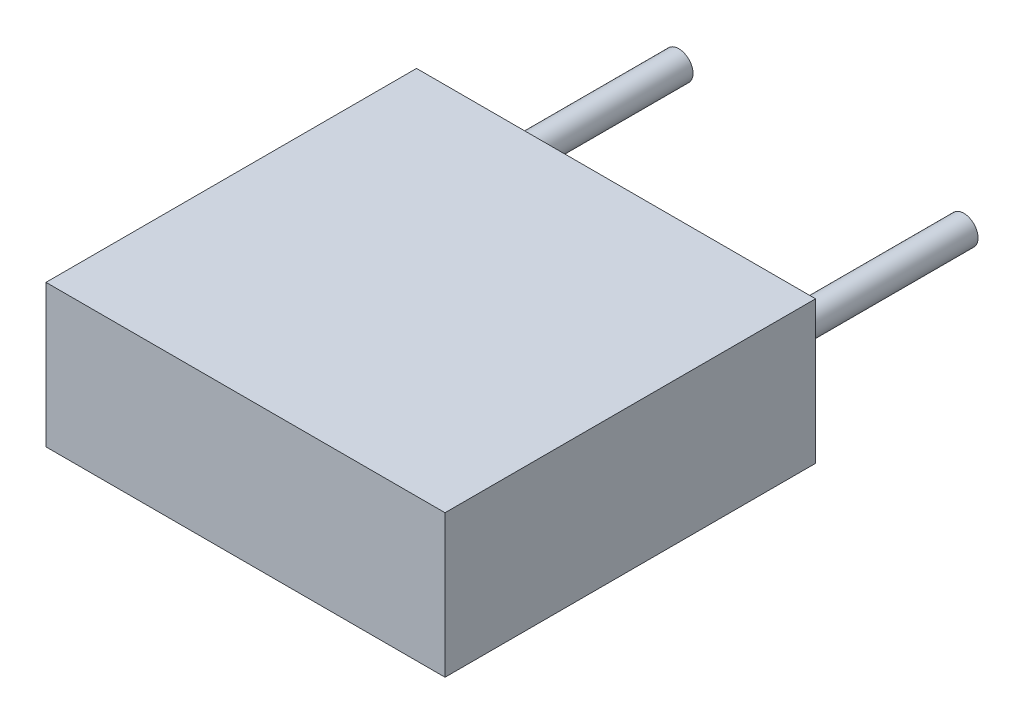
ISO-10303-21;
HEADER;
FILE_DESCRIPTION(('STEP AP214'),'2;1');
FILE_NAME('part.step','',(''),(''),'','','');
FILE_SCHEMA(('AUTOMOTIVE_DESIGN { 1 0 10303 214 1 1 1 1 }'));
ENDSEC;
DATA;
#1=APPLICATION_CONTEXT('core data for automotive mechanical design processes');
#2=APPLICATION_PROTOCOL_DEFINITION('international standard','automotive_design',2000,#1);
#3=PRODUCT_CONTEXT('',#1,'mechanical');
#4=PRODUCT('Part','Part','',(#3));
#5=PRODUCT_RELATED_PRODUCT_CATEGORY('part','',(#4));
#6=PRODUCT_DEFINITION_FORMATION('','',#4);
#7=PRODUCT_DEFINITION_CONTEXT('part definition',#1,'design');
#8=PRODUCT_DEFINITION('design','',#6,#7);
#9=PRODUCT_DEFINITION_SHAPE('','',#8);
#10=(LENGTH_UNIT() NAMED_UNIT(*) SI_UNIT(.MILLI.,.METRE.));
#11=(NAMED_UNIT(*) PLANE_ANGLE_UNIT() SI_UNIT($,.RADIAN.));
#12=(NAMED_UNIT(*) SI_UNIT($,.STERADIAN.) SOLID_ANGLE_UNIT());
#13=UNCERTAINTY_MEASURE_WITH_UNIT(LENGTH_MEASURE(1.E-05),#10,'distance_accuracy_value','');
#14=(GEOMETRIC_REPRESENTATION_CONTEXT(3) GLOBAL_UNCERTAINTY_ASSIGNED_CONTEXT((#13)) GLOBAL_UNIT_ASSIGNED_CONTEXT((#10,
#11,#12)) REPRESENTATION_CONTEXT('',''));
#15=CARTESIAN_POINT('',(0.,0.,0.));
#16=DIRECTION('',(0.,0.,1.));
#17=DIRECTION('',(1.,0.,0.));
#18=AXIS2_PLACEMENT_3D('',#15,#16,#17);
#19=CARTESIAN_POINT('',(3.5,-1.25,6.5));
#20=DIRECTION('',(-1.,0.,0.));
#21=DIRECTION('',(0.,0.,1.));
#22=AXIS2_PLACEMENT_3D('',#19,#20,#21);
#23=PLANE('',#22);
#24=DIRECTION('',(0.,1.,0.));
#25=VECTOR('',#24,1.);
#26=CARTESIAN_POINT('',(3.5,-1.25,0.));
#27=LINE('',#26,#25);
#28=CARTESIAN_POINT('',(3.5,-1.25,0.));
#29=VERTEX_POINT('',#28);
#30=CARTESIAN_POINT('',(3.5,1.25,0.));
#31=VERTEX_POINT('',#30);
#32=EDGE_CURVE('E102',#29,#31,#27,.T.);
#33=ORIENTED_EDGE('',*,*,#32,.T.);
#34=DIRECTION('',(0.,0.,-1.));
#35=VECTOR('',#34,1.);
#36=CARTESIAN_POINT('',(3.5,1.25,6.5));
#37=LINE('',#36,#35);
#38=CARTESIAN_POINT('',(3.5,1.25,6.5));
#39=VERTEX_POINT('',#38);
#40=EDGE_CURVE('E11',#39,#31,#37,.T.);
#41=ORIENTED_EDGE('',*,*,#40,.F.);
#42=DIRECTION('',(0.,1.,0.));
#43=VECTOR('',#42,1.);
#44=CARTESIAN_POINT('',(3.5,-1.25,6.5));
#45=LINE('',#44,#43);
#46=CARTESIAN_POINT('',(3.5,-1.25,6.5));
#47=VERTEX_POINT('',#46);
#48=EDGE_CURVE('E90',#47,#39,#45,.T.);
#49=ORIENTED_EDGE('',*,*,#48,.F.);
#50=DIRECTION('',(0.,0.,-1.));
#51=VECTOR('',#50,1.);
#52=CARTESIAN_POINT('',(3.5,-1.25,6.5));
#53=LINE('',#52,#51);
#54=EDGE_CURVE('E98',#47,#29,#53,.T.);
#55=ORIENTED_EDGE('',*,*,#54,.T.);
#56=EDGE_LOOP('',(#33,#41,#49,#55));
#57=FACE_BOUND('',#56,.T.);
#58=ADVANCED_FACE('F39',(#57),#23,.F.);
#59=CARTESIAN_POINT('',(-3.5,1.25,6.5));
#60=DIRECTION('',(0.,-1.,0.));
#61=DIRECTION('',(0.,0.,-1.));
#62=AXIS2_PLACEMENT_3D('',#59,#60,#61);
#63=PLANE('',#62);
#64=DIRECTION('',(-1.,0.,0.));
#65=VECTOR('',#64,1.);
#66=CARTESIAN_POINT('',(-3.5,1.25,0.));
#67=LINE('',#66,#65);
#68=CARTESIAN_POINT('',(-3.5,1.25,0.));
#69=VERTEX_POINT('',#68);
#70=EDGE_CURVE('E94',#31,#69,#67,.T.);
#71=ORIENTED_EDGE('',*,*,#70,.T.);
#72=DIRECTION('',(0.,0.,-1.));
#73=VECTOR('',#72,1.);
#74=CARTESIAN_POINT('',(-3.5,1.25,6.5));
#75=LINE('',#74,#73);
#76=CARTESIAN_POINT('',(-3.5,1.25,6.5));
#77=VERTEX_POINT('',#76);
#78=EDGE_CURVE('E47',#77,#69,#75,.T.);
#79=ORIENTED_EDGE('',*,*,#78,.F.);
#80=DIRECTION('',(-1.,0.,0.));
#81=VECTOR('',#80,1.);
#82=CARTESIAN_POINT('',(-3.5,1.25,6.5));
#83=LINE('',#82,#81);
#84=EDGE_CURVE('E85',#39,#77,#83,.T.);
#85=ORIENTED_EDGE('',*,*,#84,.F.);
#86=ORIENTED_EDGE('',*,*,#40,.T.);
#87=EDGE_LOOP('',(#71,#79,#85,#86));
#88=FACE_BOUND('',#87,.T.);
#89=ADVANCED_FACE('F93',(#88),#63,.F.);
#90=CARTESIAN_POINT('',(-3.5,-1.25,6.5));
#91=DIRECTION('',(1.,0.,0.));
#92=DIRECTION('',(0.,0.,-1.));
#93=AXIS2_PLACEMENT_3D('',#90,#91,#92);
#94=PLANE('',#93);
#95=DIRECTION('',(0.,-1.,0.));
#96=VECTOR('',#95,1.);
#97=CARTESIAN_POINT('',(-3.5,-1.25,0.));
#98=LINE('',#97,#96);
#99=CARTESIAN_POINT('',(-3.5,-1.25,0.));
#100=VERTEX_POINT('',#99);
#101=EDGE_CURVE('E72',#69,#100,#98,.T.);
#102=ORIENTED_EDGE('',*,*,#101,.T.);
#103=DIRECTION('',(0.,0.,-1.));
#104=VECTOR('',#103,1.);
#105=CARTESIAN_POINT('',(-3.5,-1.25,6.5));
#106=LINE('',#105,#104);
#107=CARTESIAN_POINT('',(-3.5,-1.25,6.5));
#108=VERTEX_POINT('',#107);
#109=EDGE_CURVE('E95',#108,#100,#106,.T.);
#110=ORIENTED_EDGE('',*,*,#109,.F.);
#111=DIRECTION('',(0.,-1.,0.));
#112=VECTOR('',#111,1.);
#113=CARTESIAN_POINT('',(-3.5,-1.25,6.5));
#114=LINE('',#113,#112);
#115=EDGE_CURVE('E88',#77,#108,#114,.T.);
#116=ORIENTED_EDGE('',*,*,#115,.F.);
#117=ORIENTED_EDGE('',*,*,#78,.T.);
#118=EDGE_LOOP('',(#102,#110,#116,#117));
#119=FACE_BOUND('',#118,.T.);
#120=ADVANCED_FACE('F96',(#119),#94,.F.);
#121=CARTESIAN_POINT('',(-3.5,-1.25,6.5));
#122=DIRECTION('',(0.,1.,0.));
#123=DIRECTION('',(0.,0.,1.));
#124=AXIS2_PLACEMENT_3D('',#121,#122,#123);
#125=PLANE('',#124);
#126=DIRECTION('',(1.,0.,0.));
#127=VECTOR('',#126,1.);
#128=CARTESIAN_POINT('',(-3.5,-1.25,0.));
#129=LINE('',#128,#127);
#130=EDGE_CURVE('E78',#100,#29,#129,.T.);
#131=ORIENTED_EDGE('',*,*,#130,.T.);
#132=ORIENTED_EDGE('',*,*,#54,.F.);
#133=DIRECTION('',(1.,0.,0.));
#134=VECTOR('',#133,1.);
#135=CARTESIAN_POINT('',(-3.5,-1.25,6.5));
#136=LINE('',#135,#134);
#137=EDGE_CURVE('E55',#108,#47,#136,.T.);
#138=ORIENTED_EDGE('',*,*,#137,.F.);
#139=ORIENTED_EDGE('',*,*,#109,.T.);
#140=EDGE_LOOP('',(#131,#132,#138,#139));
#141=FACE_BOUND('',#140,.T.);
#142=ADVANCED_FACE('F110',(#141),#125,.F.);
#143=CARTESIAN_POINT('',(0.,0.,6.5));
#144=DIRECTION('',(0.,0.,-1.));
#145=DIRECTION('',(-1.,0.,0.));
#146=AXIS2_PLACEMENT_3D('',#143,#144,#145);
#147=PLANE('',#146);
#148=ORIENTED_EDGE('',*,*,#48,.T.);
#149=ORIENTED_EDGE('',*,*,#84,.T.);
#150=ORIENTED_EDGE('',*,*,#115,.T.);
#151=ORIENTED_EDGE('',*,*,#137,.T.);
#152=EDGE_LOOP('',(#148,#149,#150,#151));
#153=FACE_BOUND('',#152,.T.);
#154=ADVANCED_FACE('F86',(#153),#147,.F.);
#155=CARTESIAN_POINT('',(0.,0.,0.));
#156=DIRECTION('',(0.,0.,-1.));
#157=DIRECTION('',(-1.,0.,0.));
#158=AXIS2_PLACEMENT_3D('',#155,#156,#157);
#159=PLANE('',#158);
#160=CARTESIAN_POINT('',(-2.5,0.,0.));
#161=DIRECTION('',(0.,0.,-1.));
#162=DIRECTION('',(-1.,0.,0.));
#163=AXIS2_PLACEMENT_3D('',#160,#161,#162);
#164=CIRCLE('',#163,0.25);
#165=CARTESIAN_POINT('',(-2.75,0.,0.));
#166=VERTEX_POINT('',#165);
#167=EDGE_CURVE('E122',#166,#166,#164,.T.);
#168=ORIENTED_EDGE('',*,*,#167,.F.);
#169=EDGE_LOOP('',(#168));
#170=FACE_BOUND('',#169,.T.);
#171=CARTESIAN_POINT('',(2.5,0.,0.));
#172=DIRECTION('',(0.,0.,-1.));
#173=DIRECTION('',(-1.,0.,0.));
#174=AXIS2_PLACEMENT_3D('',#171,#172,#173);
#175=CIRCLE('',#174,0.25);
#176=CARTESIAN_POINT('',(2.25,0.,0.));
#177=VERTEX_POINT('',#176);
#178=EDGE_CURVE('E116',#177,#177,#175,.T.);
#179=ORIENTED_EDGE('',*,*,#178,.F.);
#180=EDGE_LOOP('',(#179));
#181=FACE_BOUND('',#180,.T.);
#182=ORIENTED_EDGE('',*,*,#32,.F.);
#183=ORIENTED_EDGE('',*,*,#130,.F.);
#184=ORIENTED_EDGE('',*,*,#101,.F.);
#185=ORIENTED_EDGE('',*,*,#70,.F.);
#186=EDGE_LOOP('',(#182,#183,#184,#185));
#187=FACE_BOUND('',#186,.T.);
#188=ADVANCED_FACE('F113',(#170,#181,#187),#159,.T.);
#189=CARTESIAN_POINT('',(2.5,0.,-3.6));
#190=DIRECTION('',(0.,0.,1.));
#191=DIRECTION('',(1.,0.,0.));
#192=AXIS2_PLACEMENT_3D('',#189,#190,#191);
#193=CYLINDRICAL_SURFACE('',#192,0.25);
#194=CARTESIAN_POINT('',(2.5,0.,-3.6));
#195=DIRECTION('',(0.,0.,-1.));
#196=DIRECTION('',(-1.,0.,0.));
#197=AXIS2_PLACEMENT_3D('',#194,#195,#196);
#198=CIRCLE('',#197,0.25);
#199=CARTESIAN_POINT('',(2.25,0.,-3.6));
#200=VERTEX_POINT('',#199);
#201=EDGE_CURVE('E105',#200,#200,#198,.T.);
#202=ORIENTED_EDGE('',*,*,#201,.F.);
#203=EDGE_LOOP('',(#202));
#204=FACE_BOUND('',#203,.T.);
#205=ORIENTED_EDGE('',*,*,#178,.T.);
#206=EDGE_LOOP('',(#205));
#207=FACE_BOUND('',#206,.T.);
#208=ADVANCED_FACE('F139',(#204,#207),#193,.T.);
#209=CARTESIAN_POINT('',(2.5,0.,-3.6));
#210=DIRECTION('',(0.,0.,-1.));
#211=DIRECTION('',(-1.,0.,0.));
#212=AXIS2_PLACEMENT_3D('',#209,#210,#211);
#213=PLANE('',#212);
#214=ORIENTED_EDGE('',*,*,#201,.T.);
#215=EDGE_LOOP('',(#214));
#216=FACE_BOUND('',#215,.T.);
#217=ADVANCED_FACE('F133',(#216),#213,.T.);
#218=CARTESIAN_POINT('',(-2.5,0.,-3.6));
#219=DIRECTION('',(0.,0.,1.));
#220=DIRECTION('',(1.,0.,0.));
#221=AXIS2_PLACEMENT_3D('',#218,#219,#220);
#222=CYLINDRICAL_SURFACE('',#221,0.25);
#223=CARTESIAN_POINT('',(-2.5,0.,-3.6));
#224=DIRECTION('',(0.,0.,-1.));
#225=DIRECTION('',(-1.,0.,0.));
#226=AXIS2_PLACEMENT_3D('',#223,#224,#225);
#227=CIRCLE('',#226,0.25);
#228=CARTESIAN_POINT('',(-2.75,0.,-3.6));
#229=VERTEX_POINT('',#228);
#230=EDGE_CURVE('E119',#229,#229,#227,.T.);
#231=ORIENTED_EDGE('',*,*,#230,.F.);
#232=EDGE_LOOP('',(#231));
#233=FACE_BOUND('',#232,.T.);
#234=ORIENTED_EDGE('',*,*,#167,.T.);
#235=EDGE_LOOP('',(#234));
#236=FACE_BOUND('',#235,.T.);
#237=ADVANCED_FACE('F130',(#233,#236),#222,.T.);
#238=CARTESIAN_POINT('',(-2.5,0.,-3.6));
#239=DIRECTION('',(0.,0.,-1.));
#240=DIRECTION('',(-1.,0.,0.));
#241=AXIS2_PLACEMENT_3D('',#238,#239,#240);
#242=PLANE('',#241);
#243=ORIENTED_EDGE('',*,*,#230,.T.);
#244=EDGE_LOOP('',(#243));
#245=FACE_BOUND('',#244,.T.);
#246=ADVANCED_FACE('F128',(#245),#242,.T.);
#247=CLOSED_SHELL('',(#58,#89,#120,#142,#154,#188,#208,#217,#237,#246));
#248=MANIFOLD_SOLID_BREP('B2',#247);
#249=ADVANCED_BREP_SHAPE_REPRESENTATION('',(#18,#248),#14);
#250=SHAPE_DEFINITION_REPRESENTATION(#9,#249);
ENDSEC;
END-ISO-10303-21;
